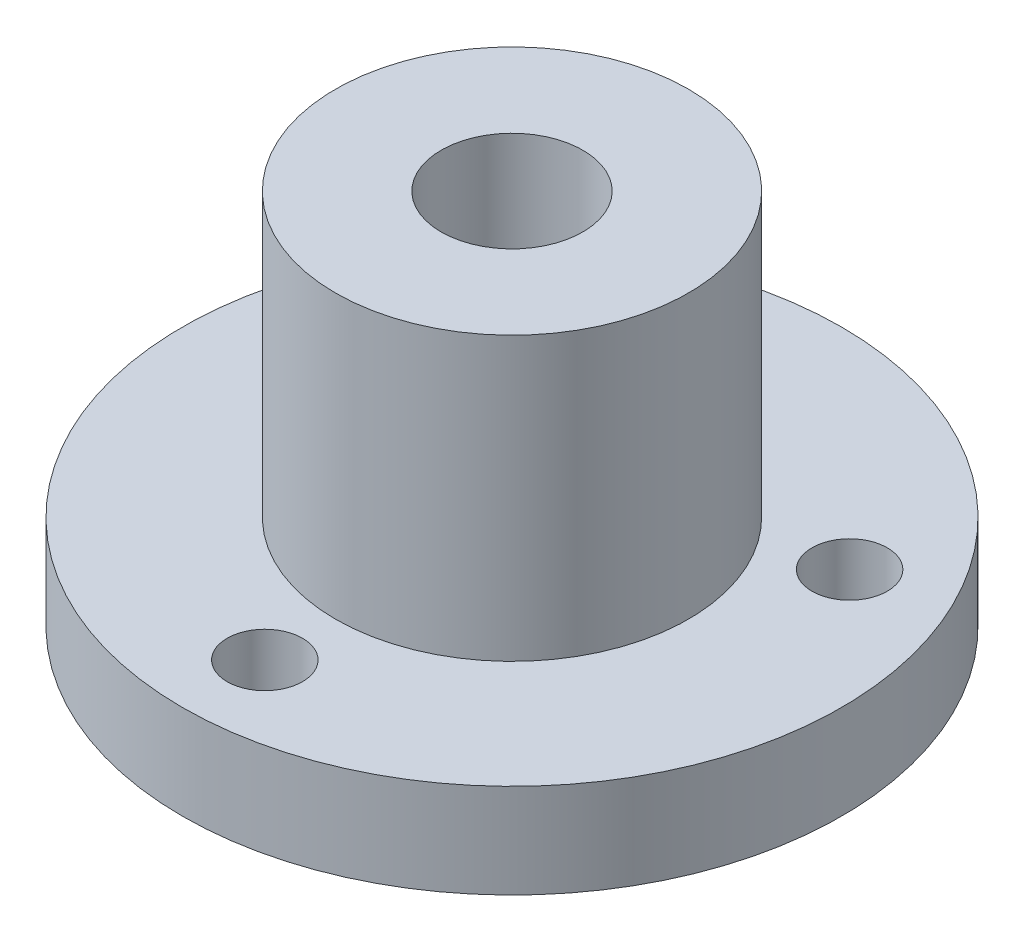
ISO-10303-21;
HEADER;
FILE_DESCRIPTION(('STEP AP214'),'2;1');
FILE_NAME('part.step','',(''),(''),'','','');
FILE_SCHEMA(('AUTOMOTIVE_DESIGN { 1 0 10303 214 1 1 1 1 }'));
ENDSEC;
DATA;
#1=APPLICATION_CONTEXT('core data for automotive mechanical design processes');
#2=APPLICATION_PROTOCOL_DEFINITION('international standard','automotive_design',2000,#1);
#3=PRODUCT_CONTEXT('',#1,'mechanical');
#4=PRODUCT('Part','Part','',(#3));
#5=PRODUCT_RELATED_PRODUCT_CATEGORY('part','',(#4));
#6=PRODUCT_DEFINITION_FORMATION('','',#4);
#7=PRODUCT_DEFINITION_CONTEXT('part definition',#1,'design');
#8=PRODUCT_DEFINITION('design','',#6,#7);
#9=PRODUCT_DEFINITION_SHAPE('','',#8);
#10=(LENGTH_UNIT() NAMED_UNIT(*) SI_UNIT(.MILLI.,.METRE.));
#11=(NAMED_UNIT(*) PLANE_ANGLE_UNIT() SI_UNIT($,.RADIAN.));
#12=(NAMED_UNIT(*) SI_UNIT($,.STERADIAN.) SOLID_ANGLE_UNIT());
#13=UNCERTAINTY_MEASURE_WITH_UNIT(LENGTH_MEASURE(1.E-05),#10,'distance_accuracy_value','');
#14=(GEOMETRIC_REPRESENTATION_CONTEXT(3) GLOBAL_UNCERTAINTY_ASSIGNED_CONTEXT((#13)) GLOBAL_UNIT_ASSIGNED_CONTEXT((#10,
#11,#12)) REPRESENTATION_CONTEXT('',''));
#15=CARTESIAN_POINT('',(0.,0.,0.));
#16=DIRECTION('',(0.,0.,1.));
#17=DIRECTION('',(1.,0.,0.));
#18=AXIS2_PLACEMENT_3D('',#15,#16,#17);
#19=CARTESIAN_POINT('',(0.,4.,0.));
#20=DIRECTION('',(0.,-1.,0.));
#21=DIRECTION('',(0.,0.,-1.));
#22=AXIS2_PLACEMENT_3D('',#19,#20,#21);
#23=CYLINDRICAL_SURFACE('',#22,14.);
#24=CARTESIAN_POINT('',(0.,4.,0.));
#25=DIRECTION('',(0.,1.,0.));
#26=DIRECTION('',(0.,0.,1.));
#27=AXIS2_PLACEMENT_3D('',#24,#25,#26);
#28=CIRCLE('',#27,14.);
#29=CARTESIAN_POINT('',(0.,4.,14.));
#30=VERTEX_POINT('',#29);
#31=EDGE_CURVE('E42',#30,#30,#28,.T.);
#32=ORIENTED_EDGE('',*,*,#31,.F.);
#33=EDGE_LOOP('',(#32));
#34=FACE_BOUND('',#33,.T.);
#35=CARTESIAN_POINT('',(0.,0.,0.));
#36=DIRECTION('',(0.,1.,0.));
#37=DIRECTION('',(0.,0.,1.));
#38=AXIS2_PLACEMENT_3D('',#35,#36,#37);
#39=CIRCLE('',#38,14.);
#40=CARTESIAN_POINT('',(0.,0.,14.));
#41=VERTEX_POINT('',#40);
#42=EDGE_CURVE('E47',#41,#41,#39,.T.);
#43=ORIENTED_EDGE('',*,*,#42,.T.);
#44=EDGE_LOOP('',(#43));
#45=FACE_BOUND('',#44,.T.);
#46=ADVANCED_FACE('F35',(#34,#45),#23,.T.);
#47=CARTESIAN_POINT('',(0.,4.,0.));
#48=DIRECTION('',(0.,1.,0.));
#49=DIRECTION('',(0.,0.,1.));
#50=AXIS2_PLACEMENT_3D('',#47,#48,#49);
#51=PLANE('',#50);
#52=CARTESIAN_POINT('',(0.,4.,10.5));
#53=DIRECTION('',(0.,1.,0.));
#54=DIRECTION('',(0.,0.,1.));
#55=AXIS2_PLACEMENT_3D('',#52,#53,#54);
#56=CIRCLE('',#55,1.6);
#57=CARTESIAN_POINT('',(0.,4.,12.1));
#58=VERTEX_POINT('',#57);
#59=EDGE_CURVE('E58',#58,#58,#56,.T.);
#60=ORIENTED_EDGE('',*,*,#59,.F.);
#61=EDGE_LOOP('',(#60));
#62=FACE_BOUND('',#61,.T.);
#63=CARTESIAN_POINT('',(9.09326673973661,4.,-5.25));
#64=DIRECTION('',(0.,1.,0.));
#65=DIRECTION('',(0.,0.,1.));
#66=AXIS2_PLACEMENT_3D('',#63,#64,#65);
#67=CIRCLE('',#66,1.6);
#68=CARTESIAN_POINT('',(9.09326673973661,4.,-3.65));
#69=VERTEX_POINT('',#68);
#70=EDGE_CURVE('E76',#69,#69,#67,.T.);
#71=ORIENTED_EDGE('',*,*,#70,.F.);
#72=EDGE_LOOP('',(#71));
#73=FACE_BOUND('',#72,.T.);
#74=CARTESIAN_POINT('',(-9.0932667397366,4.,-5.25));
#75=DIRECTION('',(0.,1.,0.));
#76=DIRECTION('',(0.,0.,1.));
#77=AXIS2_PLACEMENT_3D('',#74,#75,#76);
#78=CIRCLE('',#77,1.6);
#79=CARTESIAN_POINT('',(-9.0932667397366,4.,-3.65));
#80=VERTEX_POINT('',#79);
#81=EDGE_CURVE('E73',#80,#80,#78,.T.);
#82=ORIENTED_EDGE('',*,*,#81,.F.);
#83=EDGE_LOOP('',(#82));
#84=FACE_BOUND('',#83,.T.);
#85=CARTESIAN_POINT('',(0.,4.,0.));
#86=DIRECTION('',(0.,1.,0.));
#87=DIRECTION('',(0.,0.,1.));
#88=AXIS2_PLACEMENT_3D('',#85,#86,#87);
#89=CIRCLE('',#88,7.5);
#90=CARTESIAN_POINT('',(0.,4.,7.5));
#91=VERTEX_POINT('',#90);
#92=EDGE_CURVE('E10',#91,#91,#89,.T.);
#93=ORIENTED_EDGE('',*,*,#92,.F.);
#94=EDGE_LOOP('',(#93));
#95=FACE_BOUND('',#94,.T.);
#96=ORIENTED_EDGE('',*,*,#31,.T.);
#97=EDGE_LOOP('',(#96));
#98=FACE_BOUND('',#97,.T.);
#99=ADVANCED_FACE('F85',(#62,#73,#84,#95,#98),#51,.T.);
#100=CARTESIAN_POINT('',(0.,0.,0.));
#101=DIRECTION('',(0.,1.,0.));
#102=DIRECTION('',(0.,0.,1.));
#103=AXIS2_PLACEMENT_3D('',#100,#101,#102);
#104=PLANE('',#103);
#105=CARTESIAN_POINT('',(0.,0.,10.5));
#106=DIRECTION('',(0.,1.,0.));
#107=DIRECTION('',(0.,0.,1.));
#108=AXIS2_PLACEMENT_3D('',#105,#106,#107);
#109=CIRCLE('',#108,1.6);
#110=CARTESIAN_POINT('',(0.,0.,12.1));
#111=VERTEX_POINT('',#110);
#112=EDGE_CURVE('E38',#111,#111,#109,.T.);
#113=ORIENTED_EDGE('',*,*,#112,.T.);
#114=EDGE_LOOP('',(#113));
#115=FACE_BOUND('',#114,.T.);
#116=CARTESIAN_POINT('',(9.09326673973661,0.,-5.25));
#117=DIRECTION('',(0.,1.,0.));
#118=DIRECTION('',(0.,0.,1.));
#119=AXIS2_PLACEMENT_3D('',#116,#117,#118);
#120=CIRCLE('',#119,1.6);
#121=CARTESIAN_POINT('',(9.09326673973661,0.,-3.65));
#122=VERTEX_POINT('',#121);
#123=EDGE_CURVE('E57',#122,#122,#120,.T.);
#124=ORIENTED_EDGE('',*,*,#123,.T.);
#125=EDGE_LOOP('',(#124));
#126=FACE_BOUND('',#125,.T.);
#127=CARTESIAN_POINT('',(-9.0932667397366,0.,-5.25));
#128=DIRECTION('',(0.,1.,0.));
#129=DIRECTION('',(0.,0.,1.));
#130=AXIS2_PLACEMENT_3D('',#127,#128,#129);
#131=CIRCLE('',#130,1.6);
#132=CARTESIAN_POINT('',(-9.0932667397366,0.,-3.65));
#133=VERTEX_POINT('',#132);
#134=EDGE_CURVE('E55',#133,#133,#131,.T.);
#135=ORIENTED_EDGE('',*,*,#134,.T.);
#136=EDGE_LOOP('',(#135));
#137=FACE_BOUND('',#136,.T.);
#138=CARTESIAN_POINT('',(0.,0.,0.));
#139=DIRECTION('',(0.,1.,0.));
#140=DIRECTION('',(0.,0.,1.));
#141=AXIS2_PLACEMENT_3D('',#138,#139,#140);
#142=CIRCLE('',#141,3.01);
#143=CARTESIAN_POINT('',(0.,0.,3.01));
#144=VERTEX_POINT('',#143);
#145=EDGE_CURVE('E67',#144,#144,#142,.T.);
#146=ORIENTED_EDGE('',*,*,#145,.T.);
#147=EDGE_LOOP('',(#146));
#148=FACE_BOUND('',#147,.T.);
#149=ORIENTED_EDGE('',*,*,#42,.F.);
#150=EDGE_LOOP('',(#149));
#151=FACE_BOUND('',#150,.T.);
#152=ADVANCED_FACE('F88',(#115,#126,#137,#148,#151),#104,.F.);
#153=CARTESIAN_POINT('',(0.,16.,0.));
#154=DIRECTION('',(0.,-1.,0.));
#155=DIRECTION('',(0.,0.,-1.));
#156=AXIS2_PLACEMENT_3D('',#153,#154,#155);
#157=CYLINDRICAL_SURFACE('',#156,7.5);
#158=CARTESIAN_POINT('',(0.,16.,0.));
#159=DIRECTION('',(0.,1.,0.));
#160=DIRECTION('',(0.,0.,1.));
#161=AXIS2_PLACEMENT_3D('',#158,#159,#160);
#162=CIRCLE('',#161,7.5);
#163=CARTESIAN_POINT('',(0.,16.,7.5));
#164=VERTEX_POINT('',#163);
#165=EDGE_CURVE('E50',#164,#164,#162,.T.);
#166=ORIENTED_EDGE('',*,*,#165,.F.);
#167=EDGE_LOOP('',(#166));
#168=FACE_BOUND('',#167,.T.);
#169=ORIENTED_EDGE('',*,*,#92,.T.);
#170=EDGE_LOOP('',(#169));
#171=FACE_BOUND('',#170,.T.);
#172=ADVANCED_FACE('F102',(#168,#171),#157,.T.);
#173=CARTESIAN_POINT('',(0.,16.,0.));
#174=DIRECTION('',(0.,1.,0.));
#175=DIRECTION('',(0.,0.,1.));
#176=AXIS2_PLACEMENT_3D('',#173,#174,#175);
#177=PLANE('',#176);
#178=CARTESIAN_POINT('',(0.,16.,0.));
#179=DIRECTION('',(0.,1.,0.));
#180=DIRECTION('',(0.,0.,1.));
#181=AXIS2_PLACEMENT_3D('',#178,#179,#180);
#182=CIRCLE('',#181,3.01);
#183=CARTESIAN_POINT('',(0.,16.,3.01));
#184=VERTEX_POINT('',#183);
#185=EDGE_CURVE('E63',#184,#184,#182,.T.);
#186=ORIENTED_EDGE('',*,*,#185,.F.);
#187=EDGE_LOOP('',(#186));
#188=FACE_BOUND('',#187,.T.);
#189=ORIENTED_EDGE('',*,*,#165,.T.);
#190=EDGE_LOOP('',(#189));
#191=FACE_BOUND('',#190,.T.);
#192=ADVANCED_FACE('F106',(#188,#191),#177,.T.);
#193=CARTESIAN_POINT('',(0.,0.,0.));
#194=DIRECTION('',(0.,1.,0.));
#195=DIRECTION('',(0.,0.,1.));
#196=AXIS2_PLACEMENT_3D('',#193,#194,#195);
#197=CYLINDRICAL_SURFACE('',#196,3.01);
#198=ORIENTED_EDGE('',*,*,#145,.F.);
#199=EDGE_LOOP('',(#198));
#200=FACE_BOUND('',#199,.T.);
#201=ORIENTED_EDGE('',*,*,#185,.T.);
#202=EDGE_LOOP('',(#201));
#203=FACE_BOUND('',#202,.T.);
#204=ADVANCED_FACE('F112',(#200,#203),#197,.F.);
#205=CARTESIAN_POINT('',(-9.0932667397366,-8.,-5.25));
#206=DIRECTION('',(0.,1.,0.));
#207=DIRECTION('',(0.,0.,1.));
#208=AXIS2_PLACEMENT_3D('',#205,#206,#207);
#209=CYLINDRICAL_SURFACE('',#208,1.6);
#210=ORIENTED_EDGE('',*,*,#81,.T.);
#211=EDGE_LOOP('',(#210));
#212=FACE_BOUND('',#211,.T.);
#213=ORIENTED_EDGE('',*,*,#134,.F.);
#214=EDGE_LOOP('',(#213));
#215=FACE_BOUND('',#214,.T.);
#216=ADVANCED_FACE('F116',(#212,#215),#209,.F.);
#217=CARTESIAN_POINT('',(9.09326673973661,-8.,-5.25));
#218=DIRECTION('',(0.,1.,0.));
#219=DIRECTION('',(0.,0.,1.));
#220=AXIS2_PLACEMENT_3D('',#217,#218,#219);
#221=CYLINDRICAL_SURFACE('',#220,1.6);
#222=ORIENTED_EDGE('',*,*,#70,.T.);
#223=EDGE_LOOP('',(#222));
#224=FACE_BOUND('',#223,.T.);
#225=ORIENTED_EDGE('',*,*,#123,.F.);
#226=EDGE_LOOP('',(#225));
#227=FACE_BOUND('',#226,.T.);
#228=ADVANCED_FACE('F120',(#224,#227),#221,.F.);
#229=CARTESIAN_POINT('',(0.,-8.,10.5));
#230=DIRECTION('',(0.,1.,0.));
#231=DIRECTION('',(0.,0.,1.));
#232=AXIS2_PLACEMENT_3D('',#229,#230,#231);
#233=CYLINDRICAL_SURFACE('',#232,1.6);
#234=ORIENTED_EDGE('',*,*,#59,.T.);
#235=EDGE_LOOP('',(#234));
#236=FACE_BOUND('',#235,.T.);
#237=ORIENTED_EDGE('',*,*,#112,.F.);
#238=EDGE_LOOP('',(#237));
#239=FACE_BOUND('',#238,.T.);
#240=ADVANCED_FACE('F82',(#236,#239),#233,.F.);
#241=CLOSED_SHELL('',(#46,#99,#152,#172,#192,#204,#216,#228,#240));
#242=MANIFOLD_SOLID_BREP('B2',#241);
#243=ADVANCED_BREP_SHAPE_REPRESENTATION('',(#18,#242),#14);
#244=SHAPE_DEFINITION_REPRESENTATION(#9,#243);
ENDSEC;
END-ISO-10303-21;
